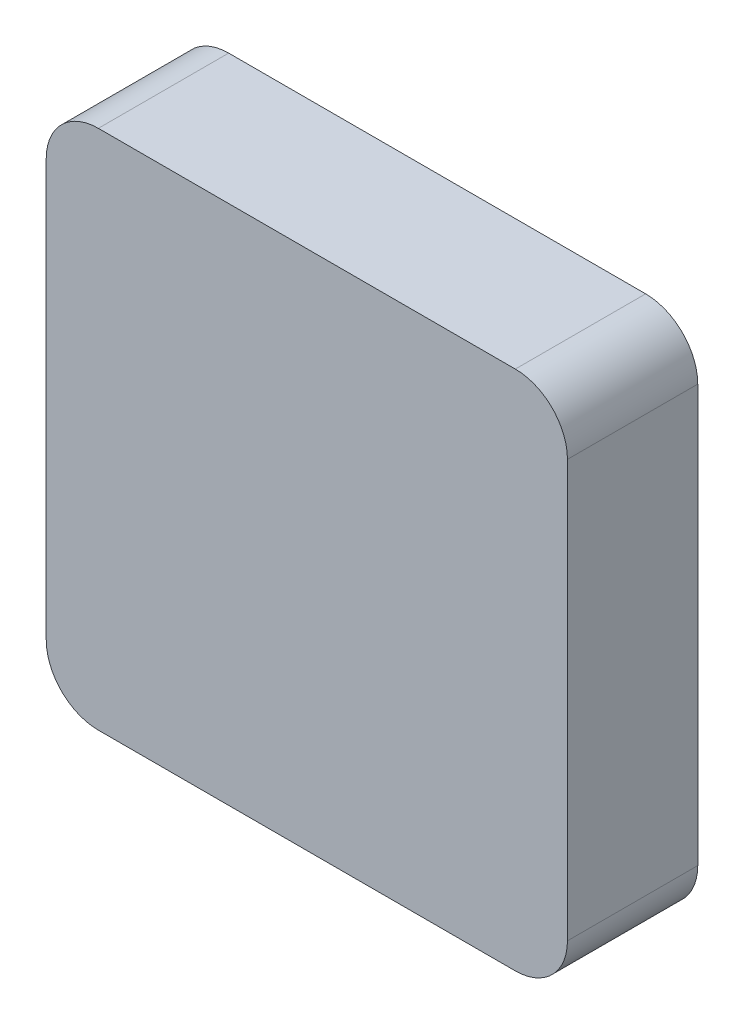
ISO-10303-21;
HEADER;
FILE_DESCRIPTION(('STEP AP214'),'2;1');
FILE_NAME('part.step','',(''),(''),'','','');
FILE_SCHEMA(('AUTOMOTIVE_DESIGN { 1 0 10303 214 1 1 1 1 }'));
ENDSEC;
DATA;
#1=APPLICATION_CONTEXT('core data for automotive mechanical design processes');
#2=APPLICATION_PROTOCOL_DEFINITION('international standard','automotive_design',2000,#1);
#3=PRODUCT_CONTEXT('',#1,'mechanical');
#4=PRODUCT('Part','Part','',(#3));
#5=PRODUCT_RELATED_PRODUCT_CATEGORY('part','',(#4));
#6=PRODUCT_DEFINITION_FORMATION('','',#4);
#7=PRODUCT_DEFINITION_CONTEXT('part definition',#1,'design');
#8=PRODUCT_DEFINITION('design','',#6,#7);
#9=PRODUCT_DEFINITION_SHAPE('','',#8);
#10=(LENGTH_UNIT() NAMED_UNIT(*) SI_UNIT(.MILLI.,.METRE.));
#11=(NAMED_UNIT(*) PLANE_ANGLE_UNIT() SI_UNIT($,.RADIAN.));
#12=(NAMED_UNIT(*) SI_UNIT($,.STERADIAN.) SOLID_ANGLE_UNIT());
#13=UNCERTAINTY_MEASURE_WITH_UNIT(LENGTH_MEASURE(1.E-05),#10,'distance_accuracy_value','');
#14=(GEOMETRIC_REPRESENTATION_CONTEXT(3) GLOBAL_UNCERTAINTY_ASSIGNED_CONTEXT((#13)) GLOBAL_UNIT_ASSIGNED_CONTEXT((#10,
#11,#12)) REPRESENTATION_CONTEXT('',''));
#15=CARTESIAN_POINT('',(0.,0.,0.));
#16=DIRECTION('',(0.,0.,1.));
#17=DIRECTION('',(1.,0.,0.));
#18=AXIS2_PLACEMENT_3D('',#15,#16,#17);
#19=CARTESIAN_POINT('',(-0.08,-0.08,0.9));
#20=DIRECTION('',(0.,0.,1.));
#21=DIRECTION('',(1.,0.,0.));
#22=AXIS2_PLACEMENT_3D('',#19,#20,#21);
#23=CYLINDRICAL_SURFACE('',#22,0.02);
#24=CARTESIAN_POINT('',(-0.08,-0.08,0.9));
#25=DIRECTION('',(0.,0.,-1.));
#26=DIRECTION('',(1.,0.,0.));
#27=AXIS2_PLACEMENT_3D('',#24,#25,#26);
#28=CIRCLE('',#27,0.02);
#29=CARTESIAN_POINT('',(-0.08,-0.1,0.9));
#30=VERTEX_POINT('',#29);
#31=CARTESIAN_POINT('',(-0.1,-0.08,0.9));
#32=VERTEX_POINT('',#31);
#33=EDGE_CURVE('E11',#30,#32,#28,.T.);
#34=ORIENTED_EDGE('',*,*,#33,.T.);
#35=DIRECTION('',(0.,0.,-1.));
#36=VECTOR('',#35,1.);
#37=CARTESIAN_POINT('',(-0.1,-0.08,0.9));
#38=LINE('',#37,#36);
#39=CARTESIAN_POINT('',(-0.1,-0.08,0.85));
#40=VERTEX_POINT('',#39);
#41=EDGE_CURVE('E27',#32,#40,#38,.T.);
#42=ORIENTED_EDGE('',*,*,#41,.T.);
#43=CARTESIAN_POINT('',(-0.08,-0.08,0.85));
#44=DIRECTION('',(0.,0.,-1.));
#45=DIRECTION('',(1.,0.,0.));
#46=AXIS2_PLACEMENT_3D('',#43,#44,#45);
#47=CIRCLE('',#46,0.02);
#48=CARTESIAN_POINT('',(-0.08,-0.1,0.85));
#49=VERTEX_POINT('',#48);
#50=EDGE_CURVE('E190',#49,#40,#47,.T.);
#51=ORIENTED_EDGE('',*,*,#50,.F.);
#52=DIRECTION('',(0.,0.,-1.));
#53=VECTOR('',#52,1.);
#54=CARTESIAN_POINT('',(-0.08,-0.1,0.9));
#55=LINE('',#54,#53);
#56=EDGE_CURVE('E147',#30,#49,#55,.T.);
#57=ORIENTED_EDGE('',*,*,#56,.F.);
#58=EDGE_LOOP('',(#34,#42,#51,#57));
#59=FACE_BOUND('',#58,.T.);
#60=ADVANCED_FACE('F16',(#59),#23,.T.);
#61=CARTESIAN_POINT('',(-0.1,0.08,0.9));
#62=DIRECTION('',(-1.,0.,0.));
#63=DIRECTION('',(0.,0.,1.));
#64=AXIS2_PLACEMENT_3D('',#61,#62,#63);
#65=PLANE('',#64);
#66=DIRECTION('',(0.,1.,0.));
#67=VECTOR('',#66,1.);
#68=CARTESIAN_POINT('',(-0.1,0.04,0.9));
#69=LINE('',#68,#67);
#70=CARTESIAN_POINT('',(-0.1,0.08,0.9));
#71=VERTEX_POINT('',#70);
#72=EDGE_CURVE('E158',#32,#71,#69,.T.);
#73=ORIENTED_EDGE('',*,*,#72,.T.);
#74=DIRECTION('',(0.,0.,-1.));
#75=VECTOR('',#74,1.);
#76=CARTESIAN_POINT('',(-0.1,0.08,0.9));
#77=LINE('',#76,#75);
#78=CARTESIAN_POINT('',(-0.1,0.08,0.85));
#79=VERTEX_POINT('',#78);
#80=EDGE_CURVE('E241',#71,#79,#77,.T.);
#81=ORIENTED_EDGE('',*,*,#80,.T.);
#82=DIRECTION('',(0.,1.,0.));
#83=VECTOR('',#82,1.);
#84=CARTESIAN_POINT('',(-0.1,-0.08,0.85));
#85=LINE('',#84,#83);
#86=EDGE_CURVE('E197',#40,#79,#85,.T.);
#87=ORIENTED_EDGE('',*,*,#86,.F.);
#88=ORIENTED_EDGE('',*,*,#41,.F.);
#89=EDGE_LOOP('',(#73,#81,#87,#88));
#90=FACE_BOUND('',#89,.T.);
#91=ADVANCED_FACE('F313',(#90),#65,.T.);
#92=CARTESIAN_POINT('',(-0.08,0.08,0.9));
#93=DIRECTION('',(0.,0.,1.));
#94=DIRECTION('',(0.,-1.,0.));
#95=AXIS2_PLACEMENT_3D('',#92,#93,#94);
#96=CYLINDRICAL_SURFACE('',#95,0.02);
#97=CARTESIAN_POINT('',(-0.08,0.08,0.9));
#98=DIRECTION('',(0.,0.,-1.));
#99=DIRECTION('',(0.,-1.,0.));
#100=AXIS2_PLACEMENT_3D('',#97,#98,#99);
#101=CIRCLE('',#100,0.02);
#102=CARTESIAN_POINT('',(-0.08,0.1,0.9));
#103=VERTEX_POINT('',#102);
#104=EDGE_CURVE('E20',#71,#103,#101,.T.);
#105=ORIENTED_EDGE('',*,*,#104,.T.);
#106=DIRECTION('',(0.,0.,1.));
#107=VECTOR('',#106,1.);
#108=CARTESIAN_POINT('',(-0.08,0.1,0.9));
#109=LINE('',#108,#107);
#110=CARTESIAN_POINT('',(-0.08,0.1,0.85));
#111=VERTEX_POINT('',#110);
#112=EDGE_CURVE('E143',#111,#103,#109,.T.);
#113=ORIENTED_EDGE('',*,*,#112,.F.);
#114=CARTESIAN_POINT('',(-0.08,0.08,0.85));
#115=DIRECTION('',(0.,0.,-1.));
#116=DIRECTION('',(0.,-1.,0.));
#117=AXIS2_PLACEMENT_3D('',#114,#115,#116);
#118=CIRCLE('',#117,0.02);
#119=EDGE_CURVE('E133',#79,#111,#118,.T.);
#120=ORIENTED_EDGE('',*,*,#119,.F.);
#121=ORIENTED_EDGE('',*,*,#80,.F.);
#122=EDGE_LOOP('',(#105,#113,#120,#121));
#123=FACE_BOUND('',#122,.T.);
#124=ADVANCED_FACE('F316',(#123),#96,.T.);
#125=CARTESIAN_POINT('',(0.08,0.1,0.9));
#126=DIRECTION('',(0.,1.,0.));
#127=DIRECTION('',(1.,0.,0.));
#128=AXIS2_PLACEMENT_3D('',#125,#126,#127);
#129=PLANE('',#128);
#130=DIRECTION('',(1.,0.,0.));
#131=VECTOR('',#130,1.);
#132=CARTESIAN_POINT('',(0.04,0.1,0.9));
#133=LINE('',#132,#131);
#134=CARTESIAN_POINT('',(0.08,0.1,0.9));
#135=VERTEX_POINT('',#134);
#136=EDGE_CURVE('E213',#103,#135,#133,.T.);
#137=ORIENTED_EDGE('',*,*,#136,.T.);
#138=DIRECTION('',(0.,0.,-1.));
#139=VECTOR('',#138,1.);
#140=CARTESIAN_POINT('',(0.08,0.1,0.9));
#141=LINE('',#140,#139);
#142=CARTESIAN_POINT('',(0.08,0.1,0.85));
#143=VERTEX_POINT('',#142);
#144=EDGE_CURVE('E146',#135,#143,#141,.T.);
#145=ORIENTED_EDGE('',*,*,#144,.T.);
#146=DIRECTION('',(1.,0.,0.));
#147=VECTOR('',#146,1.);
#148=CARTESIAN_POINT('',(-0.08,0.1,0.85));
#149=LINE('',#148,#147);
#150=EDGE_CURVE('E115',#111,#143,#149,.T.);
#151=ORIENTED_EDGE('',*,*,#150,.F.);
#152=ORIENTED_EDGE('',*,*,#112,.T.);
#153=EDGE_LOOP('',(#137,#145,#151,#152));
#154=FACE_BOUND('',#153,.T.);
#155=ADVANCED_FACE('F261',(#154),#129,.T.);
#156=CARTESIAN_POINT('',(0.,0.,0.85));
#157=DIRECTION('',(0.,0.,1.));
#158=DIRECTION('',(1.,0.,0.));
#159=AXIS2_PLACEMENT_3D('',#156,#157,#158);
#160=PLANE('',#159);
#161=ORIENTED_EDGE('',*,*,#150,.T.);
#162=CARTESIAN_POINT('',(0.08,0.08,0.85));
#163=DIRECTION('',(0.,0.,-1.));
#164=DIRECTION('',(-1.,0.,0.));
#165=AXIS2_PLACEMENT_3D('',#162,#163,#164);
#166=CIRCLE('',#165,0.02);
#167=CARTESIAN_POINT('',(0.1,0.08,0.85));
#168=VERTEX_POINT('',#167);
#169=EDGE_CURVE('E109',#143,#168,#166,.T.);
#170=ORIENTED_EDGE('',*,*,#169,.T.);
#171=DIRECTION('',(0.,-1.,0.));
#172=VECTOR('',#171,1.);
#173=CARTESIAN_POINT('',(0.1,0.08,0.85));
#174=LINE('',#173,#172);
#175=CARTESIAN_POINT('',(0.1,-0.08,0.85));
#176=VERTEX_POINT('',#175);
#177=EDGE_CURVE('E99',#168,#176,#174,.T.);
#178=ORIENTED_EDGE('',*,*,#177,.T.);
#179=CARTESIAN_POINT('',(0.08,-0.08,0.85));
#180=DIRECTION('',(0.,0.,-1.));
#181=DIRECTION('',(0.,1.,0.));
#182=AXIS2_PLACEMENT_3D('',#179,#180,#181);
#183=CIRCLE('',#182,0.02);
#184=CARTESIAN_POINT('',(0.08,-0.1,0.85));
#185=VERTEX_POINT('',#184);
#186=EDGE_CURVE('E110',#176,#185,#183,.T.);
#187=ORIENTED_EDGE('',*,*,#186,.T.);
#188=DIRECTION('',(-1.,0.,0.));
#189=VECTOR('',#188,1.);
#190=CARTESIAN_POINT('',(0.08,-0.1,0.85));
#191=LINE('',#190,#189);
#192=EDGE_CURVE('E163',#185,#49,#191,.T.);
#193=ORIENTED_EDGE('',*,*,#192,.T.);
#194=ORIENTED_EDGE('',*,*,#50,.T.);
#195=ORIENTED_EDGE('',*,*,#86,.T.);
#196=ORIENTED_EDGE('',*,*,#119,.T.);
#197=EDGE_LOOP('',(#161,#170,#178,#187,#193,#194,#195,#196));
#198=FACE_BOUND('',#197,.T.);
#199=ADVANCED_FACE('F113',(#198),#160,.F.);
#200=CARTESIAN_POINT('',(0.08,0.08,0.9));
#201=DIRECTION('',(0.,0.,1.));
#202=DIRECTION('',(-1.,0.,0.));
#203=AXIS2_PLACEMENT_3D('',#200,#201,#202);
#204=CYLINDRICAL_SURFACE('',#203,0.02);
#205=CARTESIAN_POINT('',(0.08,0.08,0.9));
#206=DIRECTION('',(0.,0.,-1.));
#207=DIRECTION('',(-1.,0.,0.));
#208=AXIS2_PLACEMENT_3D('',#205,#206,#207);
#209=CIRCLE('',#208,0.02);
#210=CARTESIAN_POINT('',(0.1,0.08,0.9));
#211=VERTEX_POINT('',#210);
#212=EDGE_CURVE('E123',#135,#211,#209,.T.);
#213=ORIENTED_EDGE('',*,*,#212,.T.);
#214=DIRECTION('',(0.,0.,-1.));
#215=VECTOR('',#214,1.);
#216=CARTESIAN_POINT('',(0.1,0.08,0.9));
#217=LINE('',#216,#215);
#218=EDGE_CURVE('E103',#211,#168,#217,.T.);
#219=ORIENTED_EDGE('',*,*,#218,.T.);
#220=ORIENTED_EDGE('',*,*,#169,.F.);
#221=ORIENTED_EDGE('',*,*,#144,.F.);
#222=EDGE_LOOP('',(#213,#219,#220,#221));
#223=FACE_BOUND('',#222,.T.);
#224=ADVANCED_FACE('F121',(#223),#204,.T.);
#225=CARTESIAN_POINT('',(0.1,-0.08,0.9));
#226=DIRECTION('',(1.,0.,0.));
#227=DIRECTION('',(0.,1.,0.));
#228=AXIS2_PLACEMENT_3D('',#225,#226,#227);
#229=PLANE('',#228);
#230=DIRECTION('',(0.,-1.,0.));
#231=VECTOR('',#230,1.);
#232=CARTESIAN_POINT('',(0.1,-0.04,0.9));
#233=LINE('',#232,#231);
#234=CARTESIAN_POINT('',(0.1,-0.08,0.9));
#235=VERTEX_POINT('',#234);
#236=EDGE_CURVE('E126',#211,#235,#233,.T.);
#237=ORIENTED_EDGE('',*,*,#236,.T.);
#238=DIRECTION('',(0.,0.,-1.));
#239=VECTOR('',#238,1.);
#240=CARTESIAN_POINT('',(0.1,-0.08,0.9));
#241=LINE('',#240,#239);
#242=EDGE_CURVE('E105',#235,#176,#241,.T.);
#243=ORIENTED_EDGE('',*,*,#242,.T.);
#244=ORIENTED_EDGE('',*,*,#177,.F.);
#245=ORIENTED_EDGE('',*,*,#218,.F.);
#246=EDGE_LOOP('',(#237,#243,#244,#245));
#247=FACE_BOUND('',#246,.T.);
#248=ADVANCED_FACE('F18',(#247),#229,.T.);
#249=CARTESIAN_POINT('',(0.08,-0.08,0.9));
#250=DIRECTION('',(0.,0.,1.));
#251=DIRECTION('',(0.,1.,0.));
#252=AXIS2_PLACEMENT_3D('',#249,#250,#251);
#253=CYLINDRICAL_SURFACE('',#252,0.02);
#254=CARTESIAN_POINT('',(0.08,-0.08,0.9));
#255=DIRECTION('',(0.,0.,-1.));
#256=DIRECTION('',(0.,1.,0.));
#257=AXIS2_PLACEMENT_3D('',#254,#255,#256);
#258=CIRCLE('',#257,0.02);
#259=CARTESIAN_POINT('',(0.08,-0.1,0.9));
#260=VERTEX_POINT('',#259);
#261=EDGE_CURVE('E138',#235,#260,#258,.T.);
#262=ORIENTED_EDGE('',*,*,#261,.T.);
#263=DIRECTION('',(0.,0.,-1.));
#264=VECTOR('',#263,1.);
#265=CARTESIAN_POINT('',(0.08,-0.1,0.9));
#266=LINE('',#265,#264);
#267=EDGE_CURVE('E142',#260,#185,#266,.T.);
#268=ORIENTED_EDGE('',*,*,#267,.T.);
#269=ORIENTED_EDGE('',*,*,#186,.F.);
#270=ORIENTED_EDGE('',*,*,#242,.F.);
#271=EDGE_LOOP('',(#262,#268,#269,#270));
#272=FACE_BOUND('',#271,.T.);
#273=ADVANCED_FACE('F307',(#272),#253,.T.);
#274=CARTESIAN_POINT('',(-0.08,-0.1,0.9));
#275=DIRECTION('',(0.,-1.,0.));
#276=DIRECTION('',(0.,0.,-1.));
#277=AXIS2_PLACEMENT_3D('',#274,#275,#276);
#278=PLANE('',#277);
#279=DIRECTION('',(-1.,0.,0.));
#280=VECTOR('',#279,1.);
#281=CARTESIAN_POINT('',(-0.04,-0.1,0.9));
#282=LINE('',#281,#280);
#283=EDGE_CURVE('E150',#260,#30,#282,.T.);
#284=ORIENTED_EDGE('',*,*,#283,.T.);
#285=ORIENTED_EDGE('',*,*,#56,.T.);
#286=ORIENTED_EDGE('',*,*,#192,.F.);
#287=ORIENTED_EDGE('',*,*,#267,.F.);
#288=EDGE_LOOP('',(#284,#285,#286,#287));
#289=FACE_BOUND('',#288,.T.);
#290=ADVANCED_FACE('F310',(#289),#278,.T.);
#291=CARTESIAN_POINT('',(0.,0.,0.9));
#292=DIRECTION('',(0.,0.,1.));
#293=DIRECTION('',(1.,0.,0.));
#294=AXIS2_PLACEMENT_3D('',#291,#292,#293);
#295=PLANE('',#294);
#296=ORIENTED_EDGE('',*,*,#212,.F.);
#297=ORIENTED_EDGE('',*,*,#136,.F.);
#298=ORIENTED_EDGE('',*,*,#104,.F.);
#299=ORIENTED_EDGE('',*,*,#72,.F.);
#300=ORIENTED_EDGE('',*,*,#33,.F.);
#301=ORIENTED_EDGE('',*,*,#283,.F.);
#302=ORIENTED_EDGE('',*,*,#261,.F.);
#303=ORIENTED_EDGE('',*,*,#236,.F.);
#304=EDGE_LOOP('',(#296,#297,#298,#299,#300,#301,#302,#303));
#305=FACE_BOUND('',#304,.T.);
#306=ADVANCED_FACE('F302',(#305),#295,.T.);
#307=CLOSED_SHELL('',(#60,#91,#124,#155,#199,#224,#248,#273,#290,#306));
#308=MANIFOLD_SOLID_BREP('B1',#307);
#309=ADVANCED_BREP_SHAPE_REPRESENTATION('',(#18,#308),#14);
#310=SHAPE_DEFINITION_REPRESENTATION(#9,#309);
ENDSEC;
END-ISO-10303-21;
